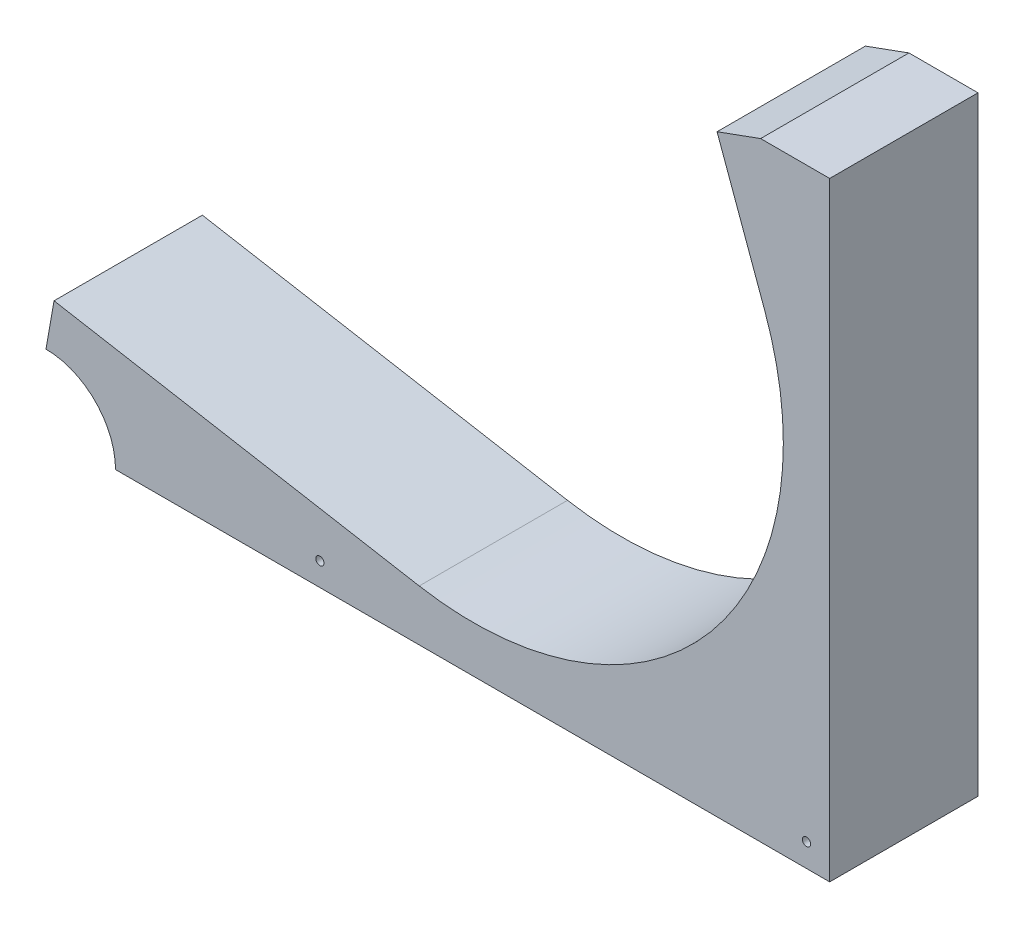
ISO-10303-21;
HEADER;
FILE_DESCRIPTION(('STEP AP214'),'2;1');
FILE_NAME('part.step','',(''),(''),'','','');
FILE_SCHEMA(('AUTOMOTIVE_DESIGN { 1 0 10303 214 1 1 1 1 }'));
ENDSEC;
DATA;
#1=APPLICATION_CONTEXT('core data for automotive mechanical design processes');
#2=APPLICATION_PROTOCOL_DEFINITION('international standard','automotive_design',2000,#1);
#3=PRODUCT_CONTEXT('',#1,'mechanical');
#4=PRODUCT('Part','Part','',(#3));
#5=PRODUCT_RELATED_PRODUCT_CATEGORY('part','',(#4));
#6=PRODUCT_DEFINITION_FORMATION('','',#4);
#7=PRODUCT_DEFINITION_CONTEXT('part definition',#1,'design');
#8=PRODUCT_DEFINITION('design','',#6,#7);
#9=PRODUCT_DEFINITION_SHAPE('','',#8);
#10=(LENGTH_UNIT() NAMED_UNIT(*) SI_UNIT(.MILLI.,.METRE.));
#11=(NAMED_UNIT(*) PLANE_ANGLE_UNIT() SI_UNIT($,.RADIAN.));
#12=(NAMED_UNIT(*) SI_UNIT($,.STERADIAN.) SOLID_ANGLE_UNIT());
#13=UNCERTAINTY_MEASURE_WITH_UNIT(LENGTH_MEASURE(1.E-05),#10,'distance_accuracy_value','');
#14=(GEOMETRIC_REPRESENTATION_CONTEXT(3) GLOBAL_UNCERTAINTY_ASSIGNED_CONTEXT((#13)) GLOBAL_UNIT_ASSIGNED_CONTEXT((#10,
#11,#12)) REPRESENTATION_CONTEXT('',''));
#15=CARTESIAN_POINT('',(0.,0.,0.));
#16=DIRECTION('',(0.,0.,1.));
#17=DIRECTION('',(1.,0.,0.));
#18=AXIS2_PLACEMENT_3D('',#15,#16,#17);
#19=CARTESIAN_POINT('',(-13.0309674607082,35.8022888519431,0.));
#20=DIRECTION('',(0.342020143325672,-0.939692620785907,0.));
#21=DIRECTION('',(0.939692620785907,0.342020143325672,0.));
#22=AXIS2_PLACEMENT_3D('',#19,#20,#21);
#23=PLANE('',#22);
#24=DIRECTION('',(0.,0.,1.));
#25=VECTOR('',#24,1.);
#26=CARTESIAN_POINT('',(78.7899693482419,69.2223767328392,-20.3199999999999));
#27=LINE('',#26,#25);
#28=CARTESIAN_POINT('',(78.7899693482418,69.2223767328392,-20.3200000000004));
#29=VERTEX_POINT('',#28);
#30=CARTESIAN_POINT('',(78.7899693482418,69.2223767328392,20.3199999999999));
#31=VERTEX_POINT('',#30);
#32=EDGE_CURVE('E187',#29,#31,#27,.T.);
#33=ORIENTED_EDGE('',*,*,#32,.F.);
#34=DIRECTION('',(0.939692620785907,0.342020143325672,0.));
#35=VECTOR('',#34,1.);
#36=CARTESIAN_POINT('',(78.7899693482419,69.2223767328392,-20.3199999999999));
#37=LINE('',#36,#35);
#38=CARTESIAN_POINT('',(66.8558730642609,64.8787209126032,-20.32));
#39=VERTEX_POINT('',#38);
#40=EDGE_CURVE('E214',#39,#29,#37,.T.);
#41=ORIENTED_EDGE('',*,*,#40,.F.);
#42=DIRECTION('',(0.,0.,-1.));
#43=VECTOR('',#42,1.);
#44=CARTESIAN_POINT('',(66.8558730642609,64.8787209126032,-20.32));
#45=LINE('',#44,#43);
#46=CARTESIAN_POINT('',(66.8558730642608,64.8787209126031,20.3200000000001));
#47=VERTEX_POINT('',#46);
#48=EDGE_CURVE('E209',#47,#39,#45,.T.);
#49=ORIENTED_EDGE('',*,*,#48,.F.);
#50=DIRECTION('',(-0.939692620785907,-0.342020143325672,0.));
#51=VECTOR('',#50,1.);
#52=CARTESIAN_POINT('',(78.7899693482418,69.2223767328392,20.3200000000001));
#53=LINE('',#52,#51);
#54=EDGE_CURVE('E189',#31,#47,#53,.T.);
#55=ORIENTED_EDGE('',*,*,#54,.F.);
#56=EDGE_LOOP('',(#33,#41,#49,#55));
#57=FACE_BOUND('',#56,.T.);
#58=ADVANCED_FACE('F79',(#57),#23,.F.);
#59=CARTESIAN_POINT('',(-100.05646770604,17.6426548509602,0.));
#60=DIRECTION('',(-0.984807753012208,0.173648177666931,0.));
#61=DIRECTION('',(-0.173648177666931,-0.984807753012208,0.));
#62=AXIS2_PLACEMENT_3D('',#59,#60,#61);
#63=PLANE('',#62);
#64=DIRECTION('',(0.,0.,1.));
#65=VECTOR('',#64,1.);
#66=CARTESIAN_POINT('',(-117.024291008951,-78.5866529653242,-20.3199999999999));
#67=LINE('',#66,#65);
#68=CARTESIAN_POINT('',(-117.024291008951,-78.5866529653242,-20.3199999999999));
#69=VERTEX_POINT('',#68);
#70=CARTESIAN_POINT('',(-117.024291008951,-78.5866529653241,20.3199999999999));
#71=VERTEX_POINT('',#70);
#72=EDGE_CURVE('E202',#69,#71,#67,.T.);
#73=ORIENTED_EDGE('',*,*,#72,.T.);
#74=DIRECTION('',(0.173648177666931,0.984807753012208,0.));
#75=VECTOR('',#74,1.);
#76=CARTESIAN_POINT('',(-117.024291008951,-78.5866529653241,20.3200000000001));
#77=LINE('',#76,#75);
#78=CARTESIAN_POINT('',(-114.818959152581,-66.0795945020691,20.3200000000001));
#79=VERTEX_POINT('',#78);
#80=EDGE_CURVE('E205',#71,#79,#77,.T.);
#81=ORIENTED_EDGE('',*,*,#80,.T.);
#82=DIRECTION('',(0.,0.,-1.));
#83=VECTOR('',#82,1.);
#84=CARTESIAN_POINT('',(-114.818959152581,-66.0795945020692,-20.32));
#85=LINE('',#84,#83);
#86=CARTESIAN_POINT('',(-114.818959152581,-66.0795945020692,-20.32));
#87=VERTEX_POINT('',#86);
#88=EDGE_CURVE('E100',#79,#87,#85,.T.);
#89=ORIENTED_EDGE('',*,*,#88,.T.);
#90=DIRECTION('',(-0.173648177666931,-0.984807753012208,0.));
#91=VECTOR('',#90,1.);
#92=CARTESIAN_POINT('',(-117.024291008951,-78.5866529653242,-20.3199999999999));
#93=LINE('',#92,#91);
#94=EDGE_CURVE('E86',#87,#69,#93,.T.);
#95=ORIENTED_EDGE('',*,*,#94,.T.);
#96=EDGE_LOOP('',(#73,#81,#89,#95));
#97=FACE_BOUND('',#96,.T.);
#98=ADVANCED_FACE('F249',(#97),#63,.T.);
#99=CARTESIAN_POINT('',(78.7899693482418,69.2223767328392,20.3200000000001));
#100=DIRECTION('',(0.,0.,1.));
#101=DIRECTION('',(1.,0.,0.));
#102=AXIS2_PLACEMENT_3D('',#99,#100,#101);
#103=PLANE('',#102);
#104=DIRECTION('',(-0.984807753012208,0.17364817766693,0.));
#105=VECTOR('',#104,1.);
#106=CARTESIAN_POINT('',(-14.7624914465408,-83.7222493530292,20.3200000000001));
#107=LINE('',#106,#105);
#108=CARTESIAN_POINT('',(-14.7624914465408,-83.7222493530292,20.3200000000001));
#109=VERTEX_POINT('',#108);
#110=EDGE_CURVE('E227',#109,#79,#107,.T.);
#111=ORIENTED_EDGE('',*,*,#110,.T.);
#112=ORIENTED_EDGE('',*,*,#80,.F.);
#113=DIRECTION('',(0.,-1.,0.));
#114=VECTOR('',#113,1.);
#115=CARTESIAN_POINT('',(-117.024291008951,0.,20.3199999999999));
#116=LINE('',#115,#114);
#117=CARTESIAN_POINT('',(-117.024291008951,-78.6637999999999,20.3199999999999));
#118=VERTEX_POINT('',#117);
#119=EDGE_CURVE('E181',#71,#118,#116,.T.);
#120=ORIENTED_EDGE('',*,*,#119,.T.);
#121=CARTESIAN_POINT('',(-117.024291008951,-97.7137999999999,20.3199999999999));
#122=DIRECTION('',(0.,0.,1.));
#123=DIRECTION('',(1.,0.,0.));
#124=AXIS2_PLACEMENT_3D('',#121,#122,#123);
#125=CIRCLE('',#124,19.05);
#126=CARTESIAN_POINT('',(-97.9742910089513,-97.7137999999999,20.3199999999999));
#127=VERTEX_POINT('',#126);
#128=EDGE_CURVE('E92',#127,#118,#125,.T.);
#129=ORIENTED_EDGE('',*,*,#128,.F.);
#130=DIRECTION('',(1.,0.,0.));
#131=VECTOR('',#130,1.);
#132=CARTESIAN_POINT('',(0.,-97.7137999999999,20.3199999999999));
#133=LINE('',#132,#131);
#134=CARTESIAN_POINT('',(97.7138,-97.7137999999999,20.3199999999999));
#135=VERTEX_POINT('',#134);
#136=EDGE_CURVE('E178',#127,#135,#133,.T.);
#137=ORIENTED_EDGE('',*,*,#136,.T.);
#138=DIRECTION('',(0.,1.,0.));
#139=VECTOR('',#138,1.);
#140=CARTESIAN_POINT('',(97.7138,0.,20.3199999999999));
#141=LINE('',#140,#139);
#142=CARTESIAN_POINT('',(97.7137999999999,69.2223767328392,20.3199999999999));
#143=VERTEX_POINT('',#142);
#144=EDGE_CURVE('E194',#135,#143,#141,.T.);
#145=ORIENTED_EDGE('',*,*,#144,.T.);
#146=DIRECTION('',(-1.,0.,0.));
#147=VECTOR('',#146,1.);
#148=CARTESIAN_POINT('',(0.,69.2223767328392,20.3199999999999));
#149=LINE('',#148,#147);
#150=EDGE_CURVE('E277',#143,#31,#149,.T.);
#151=ORIENTED_EDGE('',*,*,#150,.T.);
#152=ORIENTED_EDGE('',*,*,#54,.T.);
#153=DIRECTION('',(0.342020143325672,-0.939692620785907,0.));
#154=VECTOR('',#153,1.);
#155=CARTESIAN_POINT('',(66.8558730642608,64.8787209126031,20.3200000000001));
#156=LINE('',#155,#154);
#157=CARTESIAN_POINT('',(79.8868405249689,29.07643206066,20.3200000000001));
#158=VERTEX_POINT('',#157);
#159=EDGE_CURVE('E213',#47,#158,#156,.T.);
#160=ORIENTED_EDGE('',*,*,#159,.T.);
#161=CARTESIAN_POINT('',(0.,0.,20.3200000000001));
#162=DIRECTION('',(0.,0.,-1.));
#163=DIRECTION('',(0.939692620785907,0.342020143325673,0.));
#164=AXIS2_PLACEMENT_3D('',#161,#162,#163);
#165=CIRCLE('',#164,85.0137999999999);
#166=EDGE_CURVE('E221',#158,#109,#165,.T.);
#167=ORIENTED_EDGE('',*,*,#166,.T.);
#168=EDGE_LOOP('',(#111,#112,#120,#129,#137,#145,#151,#152,#160,#167));
#169=FACE_BOUND('',#168,.T.);
#170=CARTESIAN_POINT('',(91.3638000000008,-91.3638,20.3199999999999));
#171=DIRECTION('',(0.,0.,1.));
#172=DIRECTION('',(1.,0.,0.));
#173=AXIS2_PLACEMENT_3D('',#170,#171,#172);
#174=CIRCLE('',#173,1.1302999999991);
#175=CARTESIAN_POINT('',(92.4940999999999,-91.3638,20.3199999999999));
#176=VERTEX_POINT('',#175);
#177=EDGE_CURVE('E284',#176,#176,#174,.T.);
#178=ORIENTED_EDGE('',*,*,#177,.F.);
#179=EDGE_LOOP('',(#178));
#180=FACE_BOUND('',#179,.T.);
#181=CARTESIAN_POINT('',(-41.9734999999992,-91.3638,20.3199999999999));
#182=DIRECTION('',(0.,0.,1.));
#183=DIRECTION('',(1.,0.,0.));
#184=AXIS2_PLACEMENT_3D('',#181,#182,#183);
#185=CIRCLE('',#184,1.13029999999911);
#186=CARTESIAN_POINT('',(-40.8432000000001,-91.3638,20.3199999999999));
#187=VERTEX_POINT('',#186);
#188=EDGE_CURVE('E172',#187,#187,#185,.T.);
#189=ORIENTED_EDGE('',*,*,#188,.F.);
#190=EDGE_LOOP('',(#189));
#191=FACE_BOUND('',#190,.T.);
#192=ADVANCED_FACE('F176',(#169,#180,#191),#103,.T.);
#193=CARTESIAN_POINT('',(66.8558730642609,64.8787209126032,-20.32));
#194=DIRECTION('',(-0.939692620785907,-0.342020143325672,0.));
#195=DIRECTION('',(0.342020143325672,-0.939692620785907,0.));
#196=AXIS2_PLACEMENT_3D('',#193,#194,#195);
#197=PLANE('',#196);
#198=DIRECTION('',(0.342020143325672,-0.939692620785907,0.));
#199=VECTOR('',#198,1.);
#200=CARTESIAN_POINT('',(66.8558730642609,64.8787209126032,-20.32));
#201=LINE('',#200,#199);
#202=CARTESIAN_POINT('',(79.886840524969,29.0764320606601,-20.32));
#203=VERTEX_POINT('',#202);
#204=EDGE_CURVE('E234',#39,#203,#201,.T.);
#205=ORIENTED_EDGE('',*,*,#204,.T.);
#206=DIRECTION('',(0.,0.,-1.));
#207=VECTOR('',#206,1.);
#208=CARTESIAN_POINT('',(79.886840524969,29.0764320606601,-20.32));
#209=LINE('',#208,#207);
#210=EDGE_CURVE('E217',#158,#203,#209,.T.);
#211=ORIENTED_EDGE('',*,*,#210,.F.);
#212=ORIENTED_EDGE('',*,*,#159,.F.);
#213=ORIENTED_EDGE('',*,*,#48,.T.);
#214=EDGE_LOOP('',(#205,#211,#212,#213));
#215=FACE_BOUND('',#214,.T.);
#216=ADVANCED_FACE('F265',(#215),#197,.T.);
#217=CARTESIAN_POINT('',(78.7899693482419,69.2223767328392,-20.3199999999999));
#218=DIRECTION('',(0.,0.,-1.));
#219=DIRECTION('',(-1.,0.,0.));
#220=AXIS2_PLACEMENT_3D('',#217,#218,#219);
#221=PLANE('',#220);
#222=ORIENTED_EDGE('',*,*,#204,.F.);
#223=ORIENTED_EDGE('',*,*,#40,.T.);
#224=DIRECTION('',(-1.,0.,0.));
#225=VECTOR('',#224,1.);
#226=CARTESIAN_POINT('',(0.,69.2223767328392,-20.3200000000003));
#227=LINE('',#226,#225);
#228=CARTESIAN_POINT('',(97.7137999999999,69.2223767328392,-20.3200000000003));
#229=VERTEX_POINT('',#228);
#230=EDGE_CURVE('E270',#229,#29,#227,.T.);
#231=ORIENTED_EDGE('',*,*,#230,.F.);
#232=DIRECTION('',(0.,1.,0.));
#233=VECTOR('',#232,1.);
#234=CARTESIAN_POINT('',(97.7138,3.91458712998076E-13,-20.3200000000002));
#235=LINE('',#234,#233);
#236=CARTESIAN_POINT('',(97.7138,-97.7137999999999,-20.32));
#237=VERTEX_POINT('',#236);
#238=EDGE_CURVE('E200',#237,#229,#235,.T.);
#239=ORIENTED_EDGE('',*,*,#238,.F.);
#240=DIRECTION('',(1.,0.,0.));
#241=VECTOR('',#240,1.);
#242=CARTESIAN_POINT('',(0.,-97.7137999999999,-20.3199999999999));
#243=LINE('',#242,#241);
#244=CARTESIAN_POINT('',(-97.9742910089513,-97.7137999999999,-20.3200000000004));
#245=VERTEX_POINT('',#244);
#246=EDGE_CURVE('E199',#245,#237,#243,.T.);
#247=ORIENTED_EDGE('',*,*,#246,.F.);
#248=CARTESIAN_POINT('',(-117.024291008951,-97.7137999999999,-20.3200000000004));
#249=DIRECTION('',(0.,0.,1.));
#250=DIRECTION('',(1.,0.,0.));
#251=AXIS2_PLACEMENT_3D('',#248,#249,#250);
#252=CIRCLE('',#251,19.05);
#253=CARTESIAN_POINT('',(-117.024291008951,-78.6637999999999,-20.3200000000004));
#254=VERTEX_POINT('',#253);
#255=EDGE_CURVE('E168',#245,#254,#252,.T.);
#256=ORIENTED_EDGE('',*,*,#255,.T.);
#257=DIRECTION('',(0.,-1.,0.));
#258=VECTOR('',#257,1.);
#259=CARTESIAN_POINT('',(-117.024291008951,3.34596504567019E-13,-20.3200000000001));
#260=LINE('',#259,#258);
#261=EDGE_CURVE('E191',#69,#254,#260,.T.);
#262=ORIENTED_EDGE('',*,*,#261,.F.);
#263=ORIENTED_EDGE('',*,*,#94,.F.);
#264=DIRECTION('',(-0.984807753012208,0.17364817766693,0.));
#265=VECTOR('',#264,1.);
#266=CARTESIAN_POINT('',(-14.7624914465408,-83.7222493530293,-20.32));
#267=LINE('',#266,#265);
#268=CARTESIAN_POINT('',(-14.7624914465408,-83.7222493530293,-20.32));
#269=VERTEX_POINT('',#268);
#270=EDGE_CURVE('E243',#269,#87,#267,.T.);
#271=ORIENTED_EDGE('',*,*,#270,.F.);
#272=CARTESIAN_POINT('',(0.,0.,-20.32));
#273=DIRECTION('',(0.,0.,-1.));
#274=DIRECTION('',(0.939692620785907,0.342020143325673,0.));
#275=AXIS2_PLACEMENT_3D('',#272,#273,#274);
#276=CIRCLE('',#275,85.0138);
#277=EDGE_CURVE('E239',#203,#269,#276,.T.);
#278=ORIENTED_EDGE('',*,*,#277,.F.);
#279=EDGE_LOOP('',(#222,#223,#231,#239,#247,#256,#262,#263,#271,#278));
#280=FACE_BOUND('',#279,.T.);
#281=CARTESIAN_POINT('',(91.3638000000008,-91.3638,-20.3200000000004));
#282=DIRECTION('',(0.,0.,1.));
#283=DIRECTION('',(1.,0.,0.));
#284=AXIS2_PLACEMENT_3D('',#281,#282,#283);
#285=CIRCLE('',#284,1.1302999999991);
#286=CARTESIAN_POINT('',(92.4940999999999,-91.3638,-20.3200000000004));
#287=VERTEX_POINT('',#286);
#288=EDGE_CURVE('E280',#287,#287,#285,.T.);
#289=ORIENTED_EDGE('',*,*,#288,.T.);
#290=EDGE_LOOP('',(#289));
#291=FACE_BOUND('',#290,.T.);
#292=CARTESIAN_POINT('',(-41.9734999999992,-91.3638,-20.3200000000004));
#293=DIRECTION('',(0.,0.,1.));
#294=DIRECTION('',(1.,0.,0.));
#295=AXIS2_PLACEMENT_3D('',#292,#293,#294);
#296=CIRCLE('',#295,1.13029999999911);
#297=CARTESIAN_POINT('',(-40.8432000000001,-91.3638,-20.3200000000004));
#298=VERTEX_POINT('',#297);
#299=EDGE_CURVE('E447',#298,#298,#296,.T.);
#300=ORIENTED_EDGE('',*,*,#299,.T.);
#301=EDGE_LOOP('',(#300));
#302=FACE_BOUND('',#301,.T.);
#303=ADVANCED_FACE('F252',(#280,#291,#302),#221,.T.);
#304=CARTESIAN_POINT('',(0.,0.,0.));
#305=DIRECTION('',(0.,0.,-1.));
#306=DIRECTION('',(-1.,0.,0.));
#307=AXIS2_PLACEMENT_3D('',#304,#305,#306);
#308=CYLINDRICAL_SURFACE('',#307,85.0138);
#309=ORIENTED_EDGE('',*,*,#277,.T.);
#310=DIRECTION('',(0.,0.,-1.));
#311=VECTOR('',#310,1.);
#312=CARTESIAN_POINT('',(-14.7624914465408,-83.7222493530292,-20.32));
#313=LINE('',#312,#311);
#314=EDGE_CURVE('E225',#109,#269,#313,.T.);
#315=ORIENTED_EDGE('',*,*,#314,.F.);
#316=ORIENTED_EDGE('',*,*,#166,.F.);
#317=ORIENTED_EDGE('',*,*,#210,.T.);
#318=EDGE_LOOP('',(#309,#315,#316,#317));
#319=FACE_BOUND('',#318,.T.);
#320=ADVANCED_FACE('F259',(#319),#308,.F.);
#321=CARTESIAN_POINT('',(-14.7624914465408,-83.7222493530293,-20.32));
#322=DIRECTION('',(0.17364817766693,0.984807753012208,0.));
#323=DIRECTION('',(-0.984807753012208,0.17364817766693,0.));
#324=AXIS2_PLACEMENT_3D('',#321,#322,#323);
#325=PLANE('',#324);
#326=ORIENTED_EDGE('',*,*,#270,.T.);
#327=ORIENTED_EDGE('',*,*,#88,.F.);
#328=ORIENTED_EDGE('',*,*,#110,.F.);
#329=ORIENTED_EDGE('',*,*,#314,.T.);
#330=EDGE_LOOP('',(#326,#327,#328,#329));
#331=FACE_BOUND('',#330,.T.);
#332=ADVANCED_FACE('F256',(#331),#325,.T.);
#333=CARTESIAN_POINT('',(0.,-97.7137999999999,-158.508181191012));
#334=DIRECTION('',(0.,-1.,0.));
#335=DIRECTION('',(0.,0.,-1.));
#336=AXIS2_PLACEMENT_3D('',#333,#334,#335);
#337=PLANE('',#336);
#338=DIRECTION('',(0.,0.,1.));
#339=VECTOR('',#338,1.);
#340=CARTESIAN_POINT('',(-97.9742910089513,-97.7137999999999,-20.3200000000004));
#341=LINE('',#340,#339);
#342=EDGE_CURVE('E165',#245,#127,#341,.T.);
#343=ORIENTED_EDGE('',*,*,#342,.F.);
#344=ORIENTED_EDGE('',*,*,#246,.T.);
#345=DIRECTION('',(0.,0.,1.));
#346=VECTOR('',#345,1.);
#347=CARTESIAN_POINT('',(97.7138,-97.7137999999999,-158.508181191012));
#348=LINE('',#347,#346);
#349=EDGE_CURVE('E185',#237,#135,#348,.T.);
#350=ORIENTED_EDGE('',*,*,#349,.T.);
#351=ORIENTED_EDGE('',*,*,#136,.F.);
#352=EDGE_LOOP('',(#343,#344,#350,#351));
#353=FACE_BOUND('',#352,.T.);
#354=ADVANCED_FACE('F183',(#353),#337,.T.);
#355=CARTESIAN_POINT('',(-117.024291008951,0.,-158.508181191012));
#356=DIRECTION('',(-1.,0.,0.));
#357=DIRECTION('',(0.,0.,1.));
#358=AXIS2_PLACEMENT_3D('',#355,#356,#357);
#359=PLANE('',#358);
#360=DIRECTION('',(0.,0.,1.));
#361=VECTOR('',#360,1.);
#362=CARTESIAN_POINT('',(-117.024291008951,-78.6637999999999,-20.3200000000004));
#363=LINE('',#362,#361);
#364=EDGE_CURVE('E12',#118,#254,#363,.F.);
#365=ORIENTED_EDGE('',*,*,#364,.F.);
#366=ORIENTED_EDGE('',*,*,#119,.F.);
#367=ORIENTED_EDGE('',*,*,#72,.F.);
#368=ORIENTED_EDGE('',*,*,#261,.T.);
#369=EDGE_LOOP('',(#365,#366,#367,#368));
#370=FACE_BOUND('',#369,.T.);
#371=ADVANCED_FACE('F292',(#370),#359,.T.);
#372=CARTESIAN_POINT('',(97.7138,0.,-158.508181191012));
#373=DIRECTION('',(1.,0.,0.));
#374=DIRECTION('',(0.,1.,0.));
#375=AXIS2_PLACEMENT_3D('',#372,#373,#374);
#376=PLANE('',#375);
#377=ORIENTED_EDGE('',*,*,#349,.F.);
#378=ORIENTED_EDGE('',*,*,#238,.T.);
#379=DIRECTION('',(0.,0.,1.));
#380=VECTOR('',#379,1.);
#381=CARTESIAN_POINT('',(97.7137999999999,69.2223767328392,-158.508181191012));
#382=LINE('',#381,#380);
#383=EDGE_CURVE('E279',#229,#143,#382,.T.);
#384=ORIENTED_EDGE('',*,*,#383,.T.);
#385=ORIENTED_EDGE('',*,*,#144,.F.);
#386=EDGE_LOOP('',(#377,#378,#384,#385));
#387=FACE_BOUND('',#386,.T.);
#388=ADVANCED_FACE('F289',(#387),#376,.T.);
#389=CARTESIAN_POINT('',(0.,69.2223767328392,-158.508181191012));
#390=DIRECTION('',(0.,1.,0.));
#391=DIRECTION('',(0.,0.,1.));
#392=AXIS2_PLACEMENT_3D('',#389,#390,#391);
#393=PLANE('',#392);
#394=ORIENTED_EDGE('',*,*,#383,.F.);
#395=ORIENTED_EDGE('',*,*,#230,.T.);
#396=ORIENTED_EDGE('',*,*,#32,.T.);
#397=ORIENTED_EDGE('',*,*,#150,.F.);
#398=EDGE_LOOP('',(#394,#395,#396,#397));
#399=FACE_BOUND('',#398,.T.);
#400=ADVANCED_FACE('F276',(#399),#393,.T.);
#401=CARTESIAN_POINT('',(-41.9734999999992,-91.3638,-20.3200000000004));
#402=DIRECTION('',(0.,0.,1.));
#403=DIRECTION('',(1.,0.,0.));
#404=AXIS2_PLACEMENT_3D('',#401,#402,#403);
#405=CYLINDRICAL_SURFACE('',#404,1.13029999999911);
#406=ORIENTED_EDGE('',*,*,#299,.F.);
#407=EDGE_LOOP('',(#406));
#408=FACE_BOUND('',#407,.T.);
#409=ORIENTED_EDGE('',*,*,#188,.T.);
#410=EDGE_LOOP('',(#409));
#411=FACE_BOUND('',#410,.T.);
#412=ADVANCED_FACE('F342',(#408,#411),#405,.F.);
#413=CARTESIAN_POINT('',(91.3638000000008,-91.3638,-20.3200000000004));
#414=DIRECTION('',(0.,0.,1.));
#415=DIRECTION('',(1.,0.,0.));
#416=AXIS2_PLACEMENT_3D('',#413,#414,#415);
#417=CYLINDRICAL_SURFACE('',#416,1.1302999999991);
#418=ORIENTED_EDGE('',*,*,#288,.F.);
#419=EDGE_LOOP('',(#418));
#420=FACE_BOUND('',#419,.T.);
#421=ORIENTED_EDGE('',*,*,#177,.T.);
#422=EDGE_LOOP('',(#421));
#423=FACE_BOUND('',#422,.T.);
#424=ADVANCED_FACE('F351',(#420,#423),#417,.F.);
#425=CARTESIAN_POINT('',(-117.024291008951,-97.7137999999999,-20.3200000000004));
#426=DIRECTION('',(0.,0.,1.));
#427=DIRECTION('',(1.,0.,0.));
#428=AXIS2_PLACEMENT_3D('',#425,#426,#427);
#429=CYLINDRICAL_SURFACE('',#428,19.05);
#430=ORIENTED_EDGE('',*,*,#342,.T.);
#431=ORIENTED_EDGE('',*,*,#128,.T.);
#432=ORIENTED_EDGE('',*,*,#364,.T.);
#433=ORIENTED_EDGE('',*,*,#255,.F.);
#434=EDGE_LOOP('',(#430,#431,#432,#433));
#435=FACE_BOUND('',#434,.T.);
#436=ADVANCED_FACE('F166',(#435),#429,.F.);
#437=CLOSED_SHELL('',(#58,#98,#192,#216,#303,#320,#332,#354,#371,#388,#400,#412,#424,#436));
#438=MANIFOLD_SOLID_BREP('B2',#437);
#439=ADVANCED_BREP_SHAPE_REPRESENTATION('',(#18,#438),#14);
#440=SHAPE_DEFINITION_REPRESENTATION(#9,#439);
ENDSEC;
END-ISO-10303-21;
